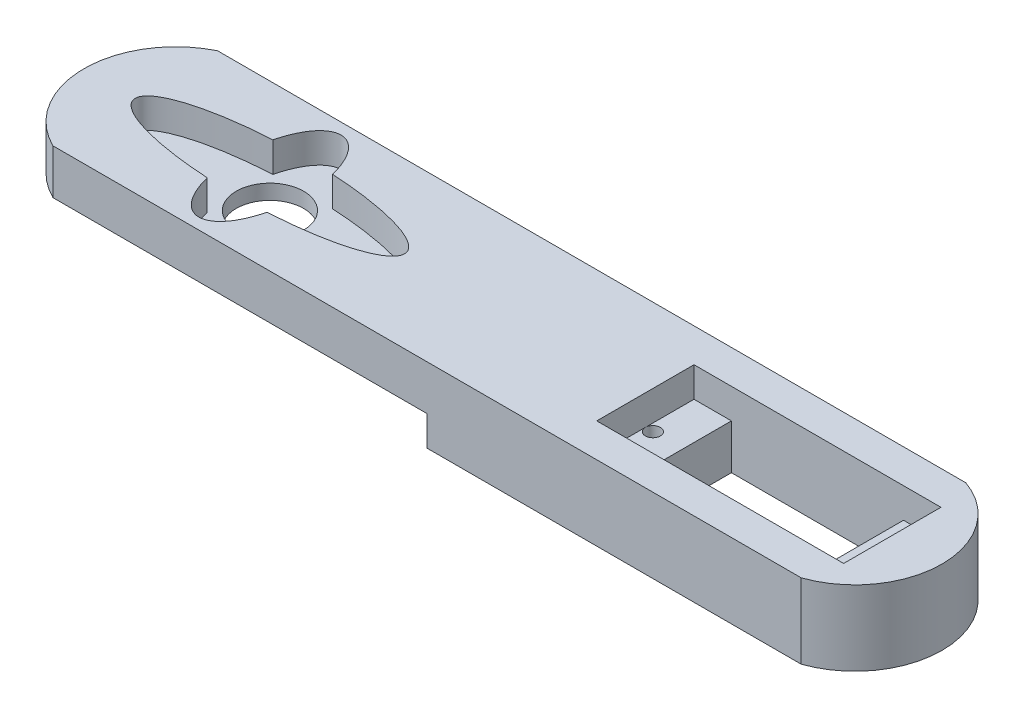
ISO-10303-21;
HEADER;
FILE_DESCRIPTION(('STEP AP214'),'2;1');
FILE_NAME('part.step','',(''),(''),'','','');
FILE_SCHEMA(('AUTOMOTIVE_DESIGN { 1 0 10303 214 1 1 1 1 }'));
ENDSEC;
DATA;
#1=APPLICATION_CONTEXT('core data for automotive mechanical design processes');
#2=APPLICATION_PROTOCOL_DEFINITION('international standard','automotive_design',2000,#1);
#3=PRODUCT_CONTEXT('',#1,'mechanical');
#4=PRODUCT('Part','Part','',(#3));
#5=PRODUCT_RELATED_PRODUCT_CATEGORY('part','',(#4));
#6=PRODUCT_DEFINITION_FORMATION('','',#4);
#7=PRODUCT_DEFINITION_CONTEXT('part definition',#1,'design');
#8=PRODUCT_DEFINITION('design','',#6,#7);
#9=PRODUCT_DEFINITION_SHAPE('','',#8);
#10=(LENGTH_UNIT() NAMED_UNIT(*) SI_UNIT(.MILLI.,.METRE.));
#11=(NAMED_UNIT(*) PLANE_ANGLE_UNIT() SI_UNIT($,.RADIAN.));
#12=(NAMED_UNIT(*) SI_UNIT($,.STERADIAN.) SOLID_ANGLE_UNIT());
#13=UNCERTAINTY_MEASURE_WITH_UNIT(LENGTH_MEASURE(1.E-05),#10,'distance_accuracy_value','');
#14=(GEOMETRIC_REPRESENTATION_CONTEXT(3) GLOBAL_UNCERTAINTY_ASSIGNED_CONTEXT((#13)) GLOBAL_UNIT_ASSIGNED_CONTEXT((#10,
#11,#12)) REPRESENTATION_CONTEXT('',''));
#15=CARTESIAN_POINT('',(0.,0.,0.));
#16=DIRECTION('',(0.,0.,1.));
#17=DIRECTION('',(1.,0.,0.));
#18=AXIS2_PLACEMENT_3D('',#15,#16,#17);
#19=CARTESIAN_POINT('',(-12.6022272183306,0.,0.));
#20=DIRECTION('',(0.,-1.,0.));
#21=DIRECTION('',(0.,0.,-1.));
#22=AXIS2_PLACEMENT_3D('',#19,#20,#21);
#23=PLANE('',#22);
#24=CARTESIAN_POINT('',(82.1764747904472,0.,0.));
#25=DIRECTION('',(0.,1.,0.));
#26=DIRECTION('',(0.,0.,1.));
#27=AXIS2_PLACEMENT_3D('',#24,#25,#26);
#28=CIRCLE('',#27,0.999999999999998);
#29=CARTESIAN_POINT('',(82.1764747904472,0.,0.999999999999998));
#30=VERTEX_POINT('',#29);
#31=EDGE_CURVE('E268',#30,#30,#28,.T.);
#32=ORIENTED_EDGE('',*,*,#31,.T.);
#33=EDGE_LOOP('',(#32));
#34=FACE_BOUND('',#33,.T.);
#35=DIRECTION('',(1.,0.,0.));
#36=VECTOR('',#35,1.);
#37=CARTESIAN_POINT('',(55.1764747904473,0.,6.5));
#38=LINE('',#37,#36);
#39=CARTESIAN_POINT('',(55.1764747904473,0.,6.5));
#40=VERTEX_POINT('',#39);
#41=CARTESIAN_POINT('',(78.1764747904472,0.,6.5));
#42=VERTEX_POINT('',#41);
#43=EDGE_CURVE('E11',#40,#42,#38,.T.);
#44=ORIENTED_EDGE('',*,*,#43,.T.);
#45=DIRECTION('',(0.,0.,-1.));
#46=VECTOR('',#45,1.);
#47=CARTESIAN_POINT('',(78.1764747904472,0.,6.5));
#48=LINE('',#47,#46);
#49=CARTESIAN_POINT('',(78.1764747904472,0.,-6.5));
#50=VERTEX_POINT('',#49);
#51=EDGE_CURVE('E291',#42,#50,#48,.T.);
#52=ORIENTED_EDGE('',*,*,#51,.T.);
#53=DIRECTION('',(1.,0.,0.));
#54=VECTOR('',#53,1.);
#55=CARTESIAN_POINT('',(55.1764747904473,0.,-6.5));
#56=LINE('',#55,#54);
#57=CARTESIAN_POINT('',(55.1764747904473,0.,-6.5));
#58=VERTEX_POINT('',#57);
#59=EDGE_CURVE('E294',#58,#50,#56,.T.);
#60=ORIENTED_EDGE('',*,*,#59,.F.);
#61=DIRECTION('',(0.,0.,-1.));
#62=VECTOR('',#61,1.);
#63=CARTESIAN_POINT('',(55.1764747904473,0.,6.5));
#64=LINE('',#63,#62);
#65=EDGE_CURVE('E298',#40,#58,#64,.T.);
#66=ORIENTED_EDGE('',*,*,#65,.F.);
#67=EDGE_LOOP('',(#44,#52,#60,#66));
#68=FACE_BOUND('',#67,.T.);
#69=CARTESIAN_POINT('',(51.1764747904473,0.,0.));
#70=DIRECTION('',(0.,-1.,0.));
#71=DIRECTION('',(0.,0.,-1.));
#72=AXIS2_PLACEMENT_3D('',#69,#70,#71);
#73=CIRCLE('',#72,0.999999999999998);
#74=CARTESIAN_POINT('',(51.1764747904473,0.,-0.999999999999994));
#75=VERTEX_POINT('',#74);
#76=EDGE_CURVE('E267',#75,#75,#73,.T.);
#77=ORIENTED_EDGE('',*,*,#76,.F.);
#78=EDGE_LOOP('',(#77));
#79=FACE_BOUND('',#78,.T.);
#80=DIRECTION('',(1.,0.,0.));
#81=VECTOR('',#80,1.);
#82=CARTESIAN_POINT('',(-18.,0.,11.));
#83=LINE('',#82,#81);
#84=CARTESIAN_POINT('',(32.,0.,11.));
#85=VERTEX_POINT('',#84);
#86=CARTESIAN_POINT('',(82.,0.,11.));
#87=VERTEX_POINT('',#86);
#88=EDGE_CURVE('E288',#85,#87,#83,.T.);
#89=ORIENTED_EDGE('',*,*,#88,.F.);
#90=DIRECTION('',(0.,0.,-1.));
#91=VECTOR('',#90,1.);
#92=CARTESIAN_POINT('',(32.,0.,11.));
#93=LINE('',#92,#91);
#94=CARTESIAN_POINT('',(32.,0.,-11.));
#95=VERTEX_POINT('',#94);
#96=EDGE_CURVE('E176',#85,#95,#93,.T.);
#97=ORIENTED_EDGE('',*,*,#96,.T.);
#98=DIRECTION('',(1.,0.,0.));
#99=VECTOR('',#98,1.);
#100=CARTESIAN_POINT('',(-18.,0.,-11.));
#101=LINE('',#100,#99);
#102=CARTESIAN_POINT('',(82.,0.,-11.));
#103=VERTEX_POINT('',#102);
#104=EDGE_CURVE('E281',#95,#103,#101,.T.);
#105=ORIENTED_EDGE('',*,*,#104,.T.);
#106=CARTESIAN_POINT('',(78.1764747904473,0.,0.));
#107=DIRECTION('',(0.,1.,0.));
#108=DIRECTION('',(0.,0.,1.));
#109=AXIS2_PLACEMENT_3D('',#106,#107,#108);
#110=CIRCLE('',#109,11.6455719064409);
#111=EDGE_CURVE('E284',#87,#103,#110,.T.);
#112=ORIENTED_EDGE('',*,*,#111,.F.);
#113=EDGE_LOOP('',(#89,#97,#105,#112));
#114=FACE_BOUND('',#113,.T.);
#115=ADVANCED_FACE('F38',(#34,#68,#79,#114),#23,.T.);
#116=CARTESIAN_POINT('',(0.,-10.,0.));
#117=DIRECTION('',(0.,1.,0.));
#118=DIRECTION('',(0.,0.,1.));
#119=AXIS2_PLACEMENT_3D('',#116,#117,#118);
#120=CYLINDRICAL_SURFACE('',#119,4.49999999999995);
#121=CARTESIAN_POINT('',(0.,6.,0.));
#122=DIRECTION('',(0.,1.,0.));
#123=DIRECTION('',(0.,0.,1.));
#124=AXIS2_PLACEMENT_3D('',#121,#122,#123);
#125=CIRCLE('',#124,4.49999999999995);
#126=CARTESIAN_POINT('',(0.,6.,4.49999999999995));
#127=VERTEX_POINT('',#126);
#128=EDGE_CURVE('E205',#127,#127,#125,.F.);
#129=ORIENTED_EDGE('',*,*,#128,.F.);
#130=EDGE_LOOP('',(#129));
#131=FACE_BOUND('',#130,.T.);
#132=CARTESIAN_POINT('',(0.,4.,0.));
#133=DIRECTION('',(0.,-1.,0.));
#134=DIRECTION('',(0.,0.,-1.));
#135=AXIS2_PLACEMENT_3D('',#132,#133,#134);
#136=CIRCLE('',#135,4.49999999999995);
#137=CARTESIAN_POINT('',(0.,4.,-4.49999999999995));
#138=VERTEX_POINT('',#137);
#139=EDGE_CURVE('E261',#138,#138,#136,.F.);
#140=ORIENTED_EDGE('',*,*,#139,.F.);
#141=EDGE_LOOP('',(#140));
#142=FACE_BOUND('',#141,.T.);
#143=ADVANCED_FACE('F395',(#131,#142),#120,.F.);
#144=CARTESIAN_POINT('',(-18.,10.,-11.));
#145=DIRECTION('',(0.,0.,-1.));
#146=DIRECTION('',(-1.,0.,0.));
#147=AXIS2_PLACEMENT_3D('',#144,#145,#146);
#148=PLANE('',#147);
#149=ORIENTED_EDGE('',*,*,#104,.F.);
#150=DIRECTION('',(0.,-1.,0.));
#151=VECTOR('',#150,1.);
#152=CARTESIAN_POINT('',(32.,4.,-11.));
#153=LINE('',#152,#151);
#154=CARTESIAN_POINT('',(32.,4.,-11.));
#155=VERTEX_POINT('',#154);
#156=EDGE_CURVE('E249',#155,#95,#153,.T.);
#157=ORIENTED_EDGE('',*,*,#156,.F.);
#158=DIRECTION('',(-1.,0.,0.));
#159=VECTOR('',#158,1.);
#160=CARTESIAN_POINT('',(32.,4.,-11.));
#161=LINE('',#160,#159);
#162=CARTESIAN_POINT('',(-18.,4.,-11.));
#163=VERTEX_POINT('',#162);
#164=EDGE_CURVE('E186',#155,#163,#161,.T.);
#165=ORIENTED_EDGE('',*,*,#164,.T.);
#166=DIRECTION('',(0.,-1.,0.));
#167=VECTOR('',#166,1.);
#168=CARTESIAN_POINT('',(-18.,10.,-11.));
#169=LINE('',#168,#167);
#170=CARTESIAN_POINT('',(-18.,10.,-11.));
#171=VERTEX_POINT('',#170);
#172=EDGE_CURVE('E47',#171,#163,#169,.T.);
#173=ORIENTED_EDGE('',*,*,#172,.F.);
#174=DIRECTION('',(1.,0.,0.));
#175=VECTOR('',#174,1.);
#176=CARTESIAN_POINT('',(-18.,10.,-11.));
#177=LINE('',#176,#175);
#178=CARTESIAN_POINT('',(82.,10.,-11.));
#179=VERTEX_POINT('',#178);
#180=EDGE_CURVE('E208',#171,#179,#177,.T.);
#181=ORIENTED_EDGE('',*,*,#180,.T.);
#182=DIRECTION('',(0.,-1.,0.));
#183=VECTOR('',#182,1.);
#184=CARTESIAN_POINT('',(82.,10.,-11.));
#185=LINE('',#184,#183);
#186=EDGE_CURVE('E198',#179,#103,#185,.T.);
#187=ORIENTED_EDGE('',*,*,#186,.T.);
#188=EDGE_LOOP('',(#149,#157,#165,#173,#181,#187));
#189=FACE_BOUND('',#188,.T.);
#190=ADVANCED_FACE('F40',(#189),#148,.T.);
#191=CARTESIAN_POINT('',(-12.6022272183306,10.,0.));
#192=DIRECTION('',(0.,-1.,0.));
#193=DIRECTION('',(0.,0.,-1.));
#194=AXIS2_PLACEMENT_3D('',#191,#192,#193);
#195=CYLINDRICAL_SURFACE('',#194,12.2529976333357);
#196=CARTESIAN_POINT('',(-12.6022272183306,4.,0.));
#197=DIRECTION('',(0.,-1.,0.));
#198=DIRECTION('',(0.,0.,-1.));
#199=AXIS2_PLACEMENT_3D('',#196,#197,#198);
#200=CIRCLE('',#199,12.2529976333357);
#201=CARTESIAN_POINT('',(-18.,4.,11.));
#202=VERTEX_POINT('',#201);
#203=EDGE_CURVE('E170',#202,#163,#200,.T.);
#204=ORIENTED_EDGE('',*,*,#203,.F.);
#205=DIRECTION('',(0.,-1.,0.));
#206=VECTOR('',#205,1.);
#207=CARTESIAN_POINT('',(-18.,10.,11.));
#208=LINE('',#207,#206);
#209=CARTESIAN_POINT('',(-18.,10.,11.));
#210=VERTEX_POINT('',#209);
#211=EDGE_CURVE('E183',#210,#202,#208,.T.);
#212=ORIENTED_EDGE('',*,*,#211,.F.);
#213=CARTESIAN_POINT('',(-12.6022272183306,10.,0.));
#214=DIRECTION('',(0.,1.,0.));
#215=DIRECTION('',(0.,0.,1.));
#216=AXIS2_PLACEMENT_3D('',#213,#214,#215);
#217=CIRCLE('',#216,12.2529976333357);
#218=EDGE_CURVE('E204',#171,#210,#217,.T.);
#219=ORIENTED_EDGE('',*,*,#218,.F.);
#220=ORIENTED_EDGE('',*,*,#172,.T.);
#221=EDGE_LOOP('',(#204,#212,#219,#220));
#222=FACE_BOUND('',#221,.T.);
#223=ADVANCED_FACE('F181',(#222),#195,.T.);
#224=CARTESIAN_POINT('',(-18.,10.,11.));
#225=DIRECTION('',(0.,0.,-1.));
#226=DIRECTION('',(-1.,0.,0.));
#227=AXIS2_PLACEMENT_3D('',#224,#225,#226);
#228=PLANE('',#227);
#229=DIRECTION('',(0.,-1.,0.));
#230=VECTOR('',#229,1.);
#231=CARTESIAN_POINT('',(32.,4.,11.));
#232=LINE('',#231,#230);
#233=CARTESIAN_POINT('',(32.,4.,11.));
#234=VERTEX_POINT('',#233);
#235=EDGE_CURVE('E258',#234,#85,#232,.T.);
#236=ORIENTED_EDGE('',*,*,#235,.T.);
#237=ORIENTED_EDGE('',*,*,#88,.T.);
#238=DIRECTION('',(0.,-1.,0.));
#239=VECTOR('',#238,1.);
#240=CARTESIAN_POINT('',(82.,10.,11.));
#241=LINE('',#240,#239);
#242=CARTESIAN_POINT('',(82.,10.,11.));
#243=VERTEX_POINT('',#242);
#244=EDGE_CURVE('E192',#243,#87,#241,.T.);
#245=ORIENTED_EDGE('',*,*,#244,.F.);
#246=DIRECTION('',(1.,0.,0.));
#247=VECTOR('',#246,1.);
#248=CARTESIAN_POINT('',(-18.,10.,11.));
#249=LINE('',#248,#247);
#250=EDGE_CURVE('E190',#210,#243,#249,.T.);
#251=ORIENTED_EDGE('',*,*,#250,.F.);
#252=ORIENTED_EDGE('',*,*,#211,.T.);
#253=DIRECTION('',(-1.,0.,0.));
#254=VECTOR('',#253,1.);
#255=CARTESIAN_POINT('',(32.,4.,11.));
#256=LINE('',#255,#254);
#257=EDGE_CURVE('E166',#234,#202,#256,.T.);
#258=ORIENTED_EDGE('',*,*,#257,.F.);
#259=EDGE_LOOP('',(#236,#237,#245,#251,#252,#258));
#260=FACE_BOUND('',#259,.T.);
#261=ADVANCED_FACE('F188',(#260),#228,.F.);
#262=CARTESIAN_POINT('',(55.1764747904473,-10.,6.5));
#263=DIRECTION('',(1.,0.,0.));
#264=DIRECTION('',(0.,0.,-1.));
#265=AXIS2_PLACEMENT_3D('',#262,#263,#264);
#266=PLANE('',#265);
#267=DIRECTION('',(0.,1.,0.));
#268=VECTOR('',#267,1.);
#269=CARTESIAN_POINT('',(55.1764747904473,-10.,6.5));
#270=LINE('',#269,#268);
#271=CARTESIAN_POINT('',(55.1764747904473,6.,6.5));
#272=VERTEX_POINT('',#271);
#273=EDGE_CURVE('E368',#40,#272,#270,.T.);
#274=ORIENTED_EDGE('',*,*,#273,.F.);
#275=ORIENTED_EDGE('',*,*,#65,.T.);
#276=DIRECTION('',(0.,1.,0.));
#277=VECTOR('',#276,1.);
#278=CARTESIAN_POINT('',(55.1764747904473,-10.,-6.5));
#279=LINE('',#278,#277);
#280=CARTESIAN_POINT('',(55.1764747904473,6.,-6.5));
#281=VERTEX_POINT('',#280);
#282=EDGE_CURVE('E365',#58,#281,#279,.T.);
#283=ORIENTED_EDGE('',*,*,#282,.T.);
#284=DIRECTION('',(0.,0.,-1.));
#285=VECTOR('',#284,1.);
#286=CARTESIAN_POINT('',(55.1764747904473,6.,6.5));
#287=LINE('',#286,#285);
#288=EDGE_CURVE('E307',#272,#281,#287,.T.);
#289=ORIENTED_EDGE('',*,*,#288,.F.);
#290=EDGE_LOOP('',(#274,#275,#283,#289));
#291=FACE_BOUND('',#290,.T.);
#292=ADVANCED_FACE('F406',(#291),#266,.T.);
#293=CARTESIAN_POINT('',(78.1764747904472,10.,0.));
#294=DIRECTION('',(0.,-1.,0.));
#295=DIRECTION('',(0.,0.,-1.));
#296=AXIS2_PLACEMENT_3D('',#293,#294,#295);
#297=CYLINDRICAL_SURFACE('',#296,11.6455719064409);
#298=ORIENTED_EDGE('',*,*,#244,.T.);
#299=ORIENTED_EDGE('',*,*,#111,.T.);
#300=ORIENTED_EDGE('',*,*,#186,.F.);
#301=CARTESIAN_POINT('',(78.1764747904472,10.,0.));
#302=DIRECTION('',(0.,-1.,0.));
#303=DIRECTION('',(0.,0.,-1.));
#304=AXIS2_PLACEMENT_3D('',#301,#302,#303);
#305=CIRCLE('',#304,11.6455719064409);
#306=EDGE_CURVE('E215',#179,#243,#305,.T.);
#307=ORIENTED_EDGE('',*,*,#306,.T.);
#308=EDGE_LOOP('',(#298,#299,#300,#307));
#309=FACE_BOUND('',#308,.T.);
#310=ADVANCED_FACE('F407',(#309),#297,.T.);
#311=CARTESIAN_POINT('',(55.1764747904473,-10.,-6.5));
#312=DIRECTION('',(0.,0.,1.));
#313=DIRECTION('',(1.,0.,0.));
#314=AXIS2_PLACEMENT_3D('',#311,#312,#313);
#315=PLANE('',#314);
#316=ORIENTED_EDGE('',*,*,#282,.F.);
#317=ORIENTED_EDGE('',*,*,#59,.T.);
#318=DIRECTION('',(0.,1.,0.));
#319=VECTOR('',#318,1.);
#320=CARTESIAN_POINT('',(78.1764747904472,-10.,-6.5));
#321=LINE('',#320,#319);
#322=CARTESIAN_POINT('',(78.1764747904472,6.,-6.5));
#323=VERTEX_POINT('',#322);
#324=EDGE_CURVE('E374',#50,#323,#321,.T.);
#325=ORIENTED_EDGE('',*,*,#324,.T.);
#326=DIRECTION('',(-1.,0.,0.));
#327=VECTOR('',#326,1.);
#328=CARTESIAN_POINT('',(83.1764747904472,6.,-6.5));
#329=LINE('',#328,#327);
#330=CARTESIAN_POINT('',(83.1764747904472,6.,-6.5));
#331=VERTEX_POINT('',#330);
#332=EDGE_CURVE('E343',#331,#323,#329,.T.);
#333=ORIENTED_EDGE('',*,*,#332,.F.);
#334=DIRECTION('',(0.,1.,0.));
#335=VECTOR('',#334,1.);
#336=CARTESIAN_POINT('',(83.1764747904472,6.,-6.5));
#337=LINE('',#336,#335);
#338=CARTESIAN_POINT('',(83.1764747904472,10.,-6.5));
#339=VERTEX_POINT('',#338);
#340=EDGE_CURVE('E302',#331,#339,#337,.T.);
#341=ORIENTED_EDGE('',*,*,#340,.T.);
#342=DIRECTION('',(1.,0.,0.));
#343=VECTOR('',#342,1.);
#344=CARTESIAN_POINT('',(55.1764747904473,10.,-6.5));
#345=LINE('',#344,#343);
#346=CARTESIAN_POINT('',(50.1764747904473,10.,-6.5));
#347=VERTEX_POINT('',#346);
#348=EDGE_CURVE('E332',#347,#339,#345,.T.);
#349=ORIENTED_EDGE('',*,*,#348,.F.);
#350=DIRECTION('',(0.,1.,0.));
#351=VECTOR('',#350,1.);
#352=CARTESIAN_POINT('',(50.1764747904473,6.,-6.5));
#353=LINE('',#352,#351);
#354=CARTESIAN_POINT('',(50.1764747904473,6.,-6.5));
#355=VERTEX_POINT('',#354);
#356=EDGE_CURVE('E321',#355,#347,#353,.T.);
#357=ORIENTED_EDGE('',*,*,#356,.F.);
#358=DIRECTION('',(1.,0.,0.));
#359=VECTOR('',#358,1.);
#360=CARTESIAN_POINT('',(50.1764747904473,6.,-6.5));
#361=LINE('',#360,#359);
#362=EDGE_CURVE('E303',#355,#281,#361,.T.);
#363=ORIENTED_EDGE('',*,*,#362,.T.);
#364=EDGE_LOOP('',(#316,#317,#325,#333,#341,#349,#357,#363));
#365=FACE_BOUND('',#364,.T.);
#366=ADVANCED_FACE('F409',(#365),#315,.T.);
#367=CARTESIAN_POINT('',(78.1764747904472,-10.,6.5));
#368=DIRECTION('',(1.,0.,0.));
#369=DIRECTION('',(0.,0.,-1.));
#370=AXIS2_PLACEMENT_3D('',#367,#368,#369);
#371=PLANE('',#370);
#372=ORIENTED_EDGE('',*,*,#51,.F.);
#373=DIRECTION('',(0.,1.,0.));
#374=VECTOR('',#373,1.);
#375=CARTESIAN_POINT('',(78.1764747904472,-10.,6.5));
#376=LINE('',#375,#374);
#377=CARTESIAN_POINT('',(78.1764747904472,6.,6.5));
#378=VERTEX_POINT('',#377);
#379=EDGE_CURVE('E371',#42,#378,#376,.T.);
#380=ORIENTED_EDGE('',*,*,#379,.T.);
#381=DIRECTION('',(0.,0.,-1.));
#382=VECTOR('',#381,1.);
#383=CARTESIAN_POINT('',(78.1764747904472,6.,6.5));
#384=LINE('',#383,#382);
#385=EDGE_CURVE('E352',#378,#323,#384,.T.);
#386=ORIENTED_EDGE('',*,*,#385,.T.);
#387=ORIENTED_EDGE('',*,*,#324,.F.);
#388=EDGE_LOOP('',(#372,#380,#386,#387));
#389=FACE_BOUND('',#388,.T.);
#390=ADVANCED_FACE('F415',(#389),#371,.F.);
#391=CARTESIAN_POINT('',(55.1764747904473,-10.,6.5));
#392=DIRECTION('',(0.,0.,1.));
#393=DIRECTION('',(1.,0.,0.));
#394=AXIS2_PLACEMENT_3D('',#391,#392,#393);
#395=PLANE('',#394);
#396=ORIENTED_EDGE('',*,*,#43,.F.);
#397=ORIENTED_EDGE('',*,*,#273,.T.);
#398=DIRECTION('',(1.,0.,0.));
#399=VECTOR('',#398,1.);
#400=CARTESIAN_POINT('',(50.1764747904473,6.,6.5));
#401=LINE('',#400,#399);
#402=CARTESIAN_POINT('',(50.1764747904473,6.,6.5));
#403=VERTEX_POINT('',#402);
#404=EDGE_CURVE('E312',#403,#272,#401,.T.);
#405=ORIENTED_EDGE('',*,*,#404,.F.);
#406=DIRECTION('',(0.,1.,0.));
#407=VECTOR('',#406,1.);
#408=CARTESIAN_POINT('',(50.1764747904473,6.,6.5));
#409=LINE('',#408,#407);
#410=CARTESIAN_POINT('',(50.1764747904473,10.,6.5));
#411=VERTEX_POINT('',#410);
#412=EDGE_CURVE('E328',#403,#411,#409,.T.);
#413=ORIENTED_EDGE('',*,*,#412,.T.);
#414=DIRECTION('',(1.,0.,0.));
#415=VECTOR('',#414,1.);
#416=CARTESIAN_POINT('',(55.1764747904473,10.,6.5));
#417=LINE('',#416,#415);
#418=CARTESIAN_POINT('',(83.1764747904472,10.,6.5));
#419=VERTEX_POINT('',#418);
#420=EDGE_CURVE('E362',#411,#419,#417,.T.);
#421=ORIENTED_EDGE('',*,*,#420,.T.);
#422=DIRECTION('',(0.,1.,0.));
#423=VECTOR('',#422,1.);
#424=CARTESIAN_POINT('',(83.1764747904472,6.,6.5));
#425=LINE('',#424,#423);
#426=CARTESIAN_POINT('',(83.1764747904472,6.,6.5));
#427=VERTEX_POINT('',#426);
#428=EDGE_CURVE('E333',#427,#419,#425,.T.);
#429=ORIENTED_EDGE('',*,*,#428,.F.);
#430=DIRECTION('',(-1.,0.,0.));
#431=VECTOR('',#430,1.);
#432=CARTESIAN_POINT('',(83.1764747904472,6.,6.5));
#433=LINE('',#432,#431);
#434=EDGE_CURVE('E348',#427,#378,#433,.T.);
#435=ORIENTED_EDGE('',*,*,#434,.T.);
#436=ORIENTED_EDGE('',*,*,#379,.F.);
#437=EDGE_LOOP('',(#396,#397,#405,#413,#421,#429,#435,#436));
#438=FACE_BOUND('',#437,.T.);
#439=ADVANCED_FACE('F401',(#438),#395,.F.);
#440=CARTESIAN_POINT('',(78.1764747904472,10.,0.));
#441=DIRECTION('',(0.,-1.,0.));
#442=DIRECTION('',(0.,0.,-1.));
#443=AXIS2_PLACEMENT_3D('',#440,#441,#442);
#444=PLANE('',#443);
#445=CARTESIAN_POINT('',(0.,10.,0.));
#446=DIRECTION('',(0.,1.,0.));
#447=DIRECTION('',(1.,0.,0.));
#448=AXIS2_PLACEMENT_3D('',#445,#446,#447);
#449=ELLIPSE('',#448,18.,4.49999999999995);
#450=CARTESIAN_POINT('',(-3.99121071229719,10.,-4.3879824310983));
#451=VERTEX_POINT('',#450);
#452=CARTESIAN_POINT('',(-3.99121071229719,10.,4.3879824310983));
#453=VERTEX_POINT('',#452);
#454=EDGE_CURVE('E468',#451,#453,#449,.T.);
#455=ORIENTED_EDGE('',*,*,#454,.F.);
#456=CARTESIAN_POINT('',(0.,10.,0.));
#457=DIRECTION('',(0.,1.,0.));
#458=DIRECTION('',(0.,0.,-1.));
#459=AXIS2_PLACEMENT_3D('',#456,#457,#458);
#460=ELLIPSE('',#459,9.5,4.49999999999995);
#461=CARTESIAN_POINT('',(3.99121071229718,10.,-4.3879824310983));
#462=VERTEX_POINT('',#461);
#463=EDGE_CURVE('E377',#462,#451,#460,.T.);
#464=ORIENTED_EDGE('',*,*,#463,.F.);
#465=CARTESIAN_POINT('',(0.,10.,0.));
#466=DIRECTION('',(0.,1.,0.));
#467=DIRECTION('',(1.,0.,0.));
#468=AXIS2_PLACEMENT_3D('',#465,#466,#467);
#469=ELLIPSE('',#468,18.,4.49999999999995);
#470=CARTESIAN_POINT('',(3.99121071229719,10.,4.3879824310983));
#471=VERTEX_POINT('',#470);
#472=EDGE_CURVE('E226',#471,#462,#469,.T.);
#473=ORIENTED_EDGE('',*,*,#472,.F.);
#474=CARTESIAN_POINT('',(0.,10.,0.));
#475=DIRECTION('',(0.,1.,0.));
#476=DIRECTION('',(0.,0.,-1.));
#477=AXIS2_PLACEMENT_3D('',#474,#475,#476);
#478=ELLIPSE('',#477,9.5,4.49999999999995);
#479=EDGE_CURVE('E471',#453,#471,#478,.T.);
#480=ORIENTED_EDGE('',*,*,#479,.F.);
#481=EDGE_LOOP('',(#455,#464,#473,#480));
#482=FACE_BOUND('',#481,.T.);
#483=ORIENTED_EDGE('',*,*,#180,.F.);
#484=ORIENTED_EDGE('',*,*,#218,.T.);
#485=ORIENTED_EDGE('',*,*,#250,.T.);
#486=ORIENTED_EDGE('',*,*,#306,.F.);
#487=EDGE_LOOP('',(#483,#484,#485,#486));
#488=FACE_BOUND('',#487,.T.);
#489=DIRECTION('',(0.,0.,-1.));
#490=VECTOR('',#489,1.);
#491=CARTESIAN_POINT('',(50.1764747904473,10.,6.5));
#492=LINE('',#491,#490);
#493=EDGE_CURVE('E308',#411,#347,#492,.T.);
#494=ORIENTED_EDGE('',*,*,#493,.T.);
#495=ORIENTED_EDGE('',*,*,#348,.T.);
#496=DIRECTION('',(0.,0.,-1.));
#497=VECTOR('',#496,1.);
#498=CARTESIAN_POINT('',(83.1764747904472,10.,6.5));
#499=LINE('',#498,#497);
#500=EDGE_CURVE('E324',#419,#339,#499,.T.);
#501=ORIENTED_EDGE('',*,*,#500,.F.);
#502=ORIENTED_EDGE('',*,*,#420,.F.);
#503=EDGE_LOOP('',(#494,#495,#501,#502));
#504=FACE_BOUND('',#503,.T.);
#505=ADVANCED_FACE('F243',(#482,#488,#504),#444,.F.);
#506=CARTESIAN_POINT('',(0.,6.,0.));
#507=DIRECTION('',(0.,1.,0.));
#508=DIRECTION('',(0.,0.,1.));
#509=AXIS2_PLACEMENT_3D('',#506,#507,#508);
#510=PLANE('',#509);
#511=CARTESIAN_POINT('',(0.,6.,0.));
#512=DIRECTION('',(0.,1.,0.));
#513=DIRECTION('',(0.,0.,-1.));
#514=AXIS2_PLACEMENT_3D('',#511,#512,#513);
#515=ELLIPSE('',#514,9.5,4.49999999999995);
#516=CARTESIAN_POINT('',(3.99121071229718,6.,-4.3879824310983));
#517=VERTEX_POINT('',#516);
#518=CARTESIAN_POINT('',(-3.99121071229719,6.,-4.3879824310983));
#519=VERTEX_POINT('',#518);
#520=EDGE_CURVE('E378',#517,#519,#515,.T.);
#521=ORIENTED_EDGE('',*,*,#520,.T.);
#522=CARTESIAN_POINT('',(0.,6.,0.));
#523=DIRECTION('',(0.,1.,0.));
#524=DIRECTION('',(1.,0.,0.));
#525=AXIS2_PLACEMENT_3D('',#522,#523,#524);
#526=ELLIPSE('',#525,18.,4.49999999999995);
#527=CARTESIAN_POINT('',(-3.99121071229719,6.,4.3879824310983));
#528=VERTEX_POINT('',#527);
#529=EDGE_CURVE('E383',#519,#528,#526,.T.);
#530=ORIENTED_EDGE('',*,*,#529,.T.);
#531=CARTESIAN_POINT('',(0.,6.,0.));
#532=DIRECTION('',(0.,1.,0.));
#533=DIRECTION('',(0.,0.,-1.));
#534=AXIS2_PLACEMENT_3D('',#531,#532,#533);
#535=ELLIPSE('',#534,9.5,4.49999999999995);
#536=CARTESIAN_POINT('',(3.99121071229719,6.,4.3879824310983));
#537=VERTEX_POINT('',#536);
#538=EDGE_CURVE('E464',#528,#537,#535,.T.);
#539=ORIENTED_EDGE('',*,*,#538,.T.);
#540=CARTESIAN_POINT('',(0.,6.,0.));
#541=DIRECTION('',(0.,1.,0.));
#542=DIRECTION('',(1.,0.,0.));
#543=AXIS2_PLACEMENT_3D('',#540,#541,#542);
#544=ELLIPSE('',#543,18.,4.49999999999995);
#545=EDGE_CURVE('E234',#537,#517,#544,.T.);
#546=ORIENTED_EDGE('',*,*,#545,.T.);
#547=EDGE_LOOP('',(#521,#530,#539,#546));
#548=FACE_BOUND('',#547,.T.);
#549=ORIENTED_EDGE('',*,*,#128,.T.);
#550=EDGE_LOOP('',(#549));
#551=FACE_BOUND('',#550,.T.);
#552=ADVANCED_FACE('F392',(#548,#551),#510,.T.);
#553=DIRECTION('',(0.,1.,0.));
#554=VECTOR('',#553,1.);
#555=SURFACE_OF_LINEAR_EXTRUSION('',#515,#554);
#556=ORIENTED_EDGE('',*,*,#463,.T.);
#557=DIRECTION('',(0.,1.,0.));
#558=VECTOR('',#557,1.);
#559=CARTESIAN_POINT('',(-3.99121071229719,6.,-4.3879824310983));
#560=LINE('',#559,#558);
#561=EDGE_CURVE('E231',#519,#451,#560,.T.);
#562=ORIENTED_EDGE('',*,*,#561,.F.);
#563=ORIENTED_EDGE('',*,*,#520,.F.);
#564=DIRECTION('',(0.,1.,0.));
#565=VECTOR('',#564,1.);
#566=CARTESIAN_POINT('',(3.99121071229718,6.,-4.3879824310983));
#567=LINE('',#566,#565);
#568=EDGE_CURVE('E209',#517,#462,#567,.T.);
#569=ORIENTED_EDGE('',*,*,#568,.T.);
#570=EDGE_LOOP('',(#556,#562,#563,#569));
#571=FACE_BOUND('',#570,.T.);
#572=ADVANCED_FACE('F387',(#571),#555,.F.);
#573=DIRECTION('',(0.,1.,0.));
#574=VECTOR('',#573,1.);
#575=SURFACE_OF_LINEAR_EXTRUSION('',#544,#574);
#576=ORIENTED_EDGE('',*,*,#472,.T.);
#577=ORIENTED_EDGE('',*,*,#568,.F.);
#578=ORIENTED_EDGE('',*,*,#545,.F.);
#579=DIRECTION('',(0.,1.,0.));
#580=VECTOR('',#579,1.);
#581=CARTESIAN_POINT('',(3.99121071229719,6.,4.3879824310983));
#582=LINE('',#581,#580);
#583=EDGE_CURVE('E217',#537,#471,#582,.T.);
#584=ORIENTED_EDGE('',*,*,#583,.T.);
#585=EDGE_LOOP('',(#576,#577,#578,#584));
#586=FACE_BOUND('',#585,.T.);
#587=ADVANCED_FACE('F391',(#586),#575,.F.);
#588=DIRECTION('',(0.,1.,0.));
#589=VECTOR('',#588,1.);
#590=SURFACE_OF_LINEAR_EXTRUSION('',#535,#589);
#591=ORIENTED_EDGE('',*,*,#479,.T.);
#592=ORIENTED_EDGE('',*,*,#583,.F.);
#593=ORIENTED_EDGE('',*,*,#538,.F.);
#594=DIRECTION('',(0.,1.,0.));
#595=VECTOR('',#594,1.);
#596=CARTESIAN_POINT('',(-3.99121071229719,6.,4.3879824310983));
#597=LINE('',#596,#595);
#598=EDGE_CURVE('E223',#528,#453,#597,.T.);
#599=ORIENTED_EDGE('',*,*,#598,.T.);
#600=EDGE_LOOP('',(#591,#592,#593,#599));
#601=FACE_BOUND('',#600,.T.);
#602=ADVANCED_FACE('F458',(#601),#590,.F.);
#603=DIRECTION('',(0.,1.,0.));
#604=VECTOR('',#603,1.);
#605=SURFACE_OF_LINEAR_EXTRUSION('',#526,#604);
#606=ORIENTED_EDGE('',*,*,#454,.T.);
#607=ORIENTED_EDGE('',*,*,#598,.F.);
#608=ORIENTED_EDGE('',*,*,#529,.F.);
#609=ORIENTED_EDGE('',*,*,#561,.T.);
#610=EDGE_LOOP('',(#606,#607,#608,#609));
#611=FACE_BOUND('',#610,.T.);
#612=ADVANCED_FACE('F393',(#611),#605,.F.);
#613=CARTESIAN_POINT('',(50.1764747904473,6.,6.5));
#614=DIRECTION('',(1.,0.,0.));
#615=DIRECTION('',(0.,0.,-1.));
#616=AXIS2_PLACEMENT_3D('',#613,#614,#615);
#617=PLANE('',#616);
#618=DIRECTION('',(0.,0.,-1.));
#619=VECTOR('',#618,1.);
#620=CARTESIAN_POINT('',(50.1764747904473,6.,6.5));
#621=LINE('',#620,#619);
#622=CARTESIAN_POINT('',(50.1764747904473,6.,0.));
#623=VERTEX_POINT('',#622);
#624=EDGE_CURVE('E317',#403,#623,#621,.T.);
#625=ORIENTED_EDGE('',*,*,#624,.T.);
#626=EDGE_CURVE('E316',#623,#355,#621,.T.);
#627=ORIENTED_EDGE('',*,*,#626,.T.);
#628=ORIENTED_EDGE('',*,*,#356,.T.);
#629=ORIENTED_EDGE('',*,*,#493,.F.);
#630=ORIENTED_EDGE('',*,*,#412,.F.);
#631=EDGE_LOOP('',(#625,#627,#628,#629,#630));
#632=FACE_BOUND('',#631,.T.);
#633=ADVANCED_FACE('F435',(#632),#617,.T.);
#634=CARTESIAN_POINT('',(0.,6.,0.));
#635=DIRECTION('',(0.,1.,0.));
#636=DIRECTION('',(0.,0.,1.));
#637=AXIS2_PLACEMENT_3D('',#634,#635,#636);
#638=PLANE('',#637);
#639=ORIENTED_EDGE('',*,*,#626,.F.);
#640=CARTESIAN_POINT('',(51.1764747904473,6.,0.));
#641=DIRECTION('',(0.,1.,0.));
#642=DIRECTION('',(0.,0.,1.));
#643=AXIS2_PLACEMENT_3D('',#640,#641,#642);
#644=CIRCLE('',#643,0.999999999999998);
#645=EDGE_CURVE('E60',#623,#623,#644,.F.);
#646=ORIENTED_EDGE('',*,*,#645,.T.);
#647=ORIENTED_EDGE('',*,*,#624,.F.);
#648=ORIENTED_EDGE('',*,*,#404,.T.);
#649=ORIENTED_EDGE('',*,*,#288,.T.);
#650=ORIENTED_EDGE('',*,*,#362,.F.);
#651=EDGE_LOOP('',(#639,#646,#647,#648,#649,#650));
#652=FACE_BOUND('',#651,.T.);
#653=ADVANCED_FACE('F431',(#652),#638,.T.);
#654=CARTESIAN_POINT('',(83.1764747904472,6.,6.5));
#655=DIRECTION('',(1.,0.,0.));
#656=DIRECTION('',(0.,0.,-1.));
#657=AXIS2_PLACEMENT_3D('',#654,#655,#656);
#658=PLANE('',#657);
#659=DIRECTION('',(0.,0.,-1.));
#660=VECTOR('',#659,1.);
#661=CARTESIAN_POINT('',(83.1764747904472,6.,6.5));
#662=LINE('',#661,#660);
#663=CARTESIAN_POINT('',(83.1764747904472,6.,0.));
#664=VERTEX_POINT('',#663);
#665=EDGE_CURVE('E337',#664,#331,#662,.T.);
#666=ORIENTED_EDGE('',*,*,#665,.F.);
#667=EDGE_CURVE('E344',#427,#664,#662,.T.);
#668=ORIENTED_EDGE('',*,*,#667,.F.);
#669=ORIENTED_EDGE('',*,*,#428,.T.);
#670=ORIENTED_EDGE('',*,*,#500,.T.);
#671=ORIENTED_EDGE('',*,*,#340,.F.);
#672=EDGE_LOOP('',(#666,#668,#669,#670,#671));
#673=FACE_BOUND('',#672,.T.);
#674=ADVANCED_FACE('F434',(#673),#658,.F.);
#675=CARTESIAN_POINT('',(0.,6.,0.));
#676=DIRECTION('',(0.,-1.,0.));
#677=DIRECTION('',(0.,0.,-1.));
#678=AXIS2_PLACEMENT_3D('',#675,#676,#677);
#679=PLANE('',#678);
#680=ORIENTED_EDGE('',*,*,#667,.T.);
#681=CARTESIAN_POINT('',(82.1764747904472,6.,0.));
#682=DIRECTION('',(0.,-1.,0.));
#683=DIRECTION('',(0.,0.,-1.));
#684=AXIS2_PLACEMENT_3D('',#681,#682,#683);
#685=CIRCLE('',#684,0.999999999999998);
#686=EDGE_CURVE('E277',#664,#664,#685,.T.);
#687=ORIENTED_EDGE('',*,*,#686,.T.);
#688=ORIENTED_EDGE('',*,*,#665,.T.);
#689=ORIENTED_EDGE('',*,*,#332,.T.);
#690=ORIENTED_EDGE('',*,*,#385,.F.);
#691=ORIENTED_EDGE('',*,*,#434,.F.);
#692=EDGE_LOOP('',(#680,#687,#688,#689,#690,#691));
#693=FACE_BOUND('',#692,.T.);
#694=ADVANCED_FACE('F442',(#693),#679,.F.);
#695=CARTESIAN_POINT('',(51.1764747904473,0.,0.));
#696=DIRECTION('',(0.,1.,0.));
#697=DIRECTION('',(0.,0.,1.));
#698=AXIS2_PLACEMENT_3D('',#695,#696,#697);
#699=CYLINDRICAL_SURFACE('',#698,0.999999999999998);
#700=ORIENTED_EDGE('',*,*,#645,.F.);
#701=EDGE_LOOP('',(#700));
#702=FACE_BOUND('',#701,.T.);
#703=ORIENTED_EDGE('',*,*,#76,.T.);
#704=EDGE_LOOP('',(#703));
#705=FACE_BOUND('',#704,.T.);
#706=ADVANCED_FACE('F429',(#702,#705),#699,.F.);
#707=CARTESIAN_POINT('',(82.1764747904472,0.,0.));
#708=DIRECTION('',(0.,1.,0.));
#709=DIRECTION('',(0.,0.,1.));
#710=AXIS2_PLACEMENT_3D('',#707,#708,#709);
#711=CYLINDRICAL_SURFACE('',#710,0.999999999999998);
#712=ORIENTED_EDGE('',*,*,#31,.F.);
#713=EDGE_LOOP('',(#712));
#714=FACE_BOUND('',#713,.T.);
#715=ORIENTED_EDGE('',*,*,#686,.F.);
#716=EDGE_LOOP('',(#715));
#717=FACE_BOUND('',#716,.T.);
#718=ADVANCED_FACE('F518',(#714,#717),#711,.F.);
#719=CARTESIAN_POINT('',(-12.6022272183306,4.,0.));
#720=DIRECTION('',(0.,-1.,0.));
#721=DIRECTION('',(0.,0.,-1.));
#722=AXIS2_PLACEMENT_3D('',#719,#720,#721);
#723=PLANE('',#722);
#724=ORIENTED_EDGE('',*,*,#257,.T.);
#725=ORIENTED_EDGE('',*,*,#203,.T.);
#726=ORIENTED_EDGE('',*,*,#164,.F.);
#727=DIRECTION('',(0.,0.,-1.));
#728=VECTOR('',#727,1.);
#729=CARTESIAN_POINT('',(32.,4.,11.));
#730=LINE('',#729,#728);
#731=EDGE_CURVE('E54',#234,#155,#730,.T.);
#732=ORIENTED_EDGE('',*,*,#731,.F.);
#733=EDGE_LOOP('',(#724,#725,#726,#732));
#734=FACE_BOUND('',#733,.T.);
#735=ORIENTED_EDGE('',*,*,#139,.T.);
#736=EDGE_LOOP('',(#735));
#737=FACE_BOUND('',#736,.T.);
#738=ADVANCED_FACE('F168',(#734,#737),#723,.T.);
#739=CARTESIAN_POINT('',(32.,4.,11.));
#740=DIRECTION('',(-1.,0.,0.));
#741=DIRECTION('',(0.,0.,1.));
#742=AXIS2_PLACEMENT_3D('',#739,#740,#741);
#743=PLANE('',#742);
#744=ORIENTED_EDGE('',*,*,#96,.F.);
#745=ORIENTED_EDGE('',*,*,#235,.F.);
#746=ORIENTED_EDGE('',*,*,#731,.T.);
#747=ORIENTED_EDGE('',*,*,#156,.T.);
#748=EDGE_LOOP('',(#744,#745,#746,#747));
#749=FACE_BOUND('',#748,.T.);
#750=ADVANCED_FACE('F555',(#749),#743,.T.);
#751=CLOSED_SHELL('',(#115,#143,#190,#223,#261,#292,#310,#366,#390,#439,#505,#552,#572,#587,
#602,#612,#633,#653,#674,#694,#706,#718,#738,#750));
#752=MANIFOLD_SOLID_BREP('B2',#751);
#753=ADVANCED_BREP_SHAPE_REPRESENTATION('',(#18,#752),#14);
#754=SHAPE_DEFINITION_REPRESENTATION(#9,#753);
ENDSEC;
END-ISO-10303-21;
